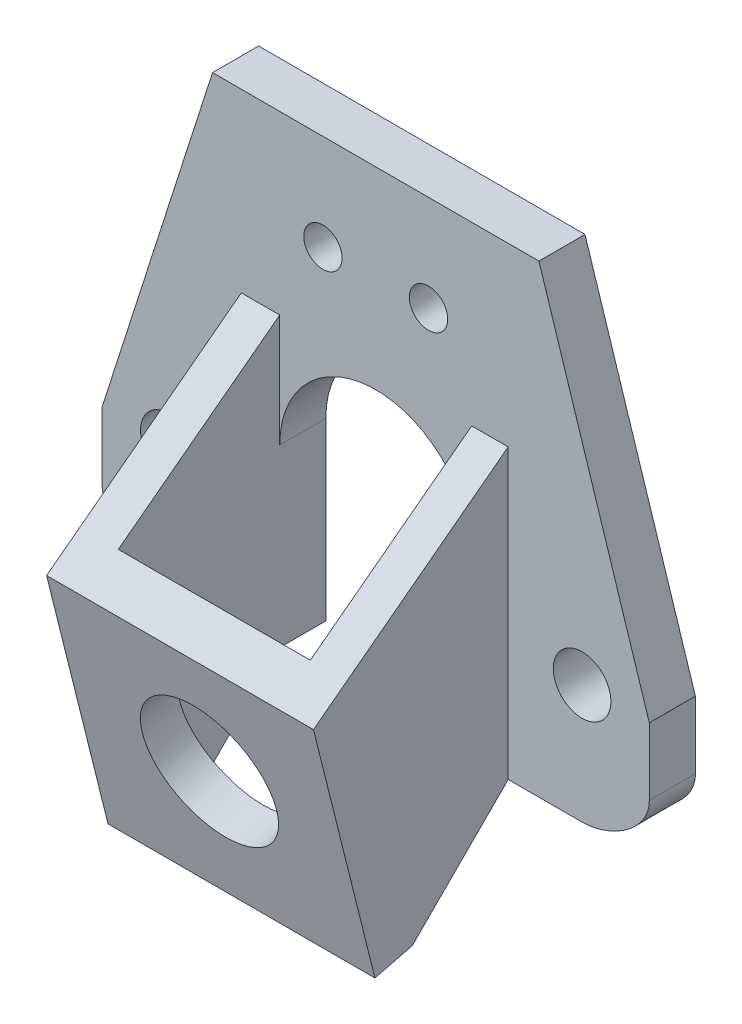
ISO-10303-21;
HEADER;
FILE_DESCRIPTION(('STEP AP214'),'2;1');
FILE_NAME('part.step','',(''),(''),'','','');
FILE_SCHEMA(('AUTOMOTIVE_DESIGN { 1 0 10303 214 1 1 1 1 }'));
ENDSEC;
DATA;
#1=APPLICATION_CONTEXT('core data for automotive mechanical design processes');
#2=APPLICATION_PROTOCOL_DEFINITION('international standard','automotive_design',2000,#1);
#3=PRODUCT_CONTEXT('',#1,'mechanical');
#4=PRODUCT('Part','Part','',(#3));
#5=PRODUCT_RELATED_PRODUCT_CATEGORY('part','',(#4));
#6=PRODUCT_DEFINITION_FORMATION('','',#4);
#7=PRODUCT_DEFINITION_CONTEXT('part definition',#1,'design');
#8=PRODUCT_DEFINITION('design','',#6,#7);
#9=PRODUCT_DEFINITION_SHAPE('','',#8);
#10=(LENGTH_UNIT() NAMED_UNIT(*) SI_UNIT(.MILLI.,.METRE.));
#11=(NAMED_UNIT(*) PLANE_ANGLE_UNIT() SI_UNIT($,.RADIAN.));
#12=(NAMED_UNIT(*) SI_UNIT($,.STERADIAN.) SOLID_ANGLE_UNIT());
#13=UNCERTAINTY_MEASURE_WITH_UNIT(LENGTH_MEASURE(1.E-05),#10,'distance_accuracy_value','');
#14=(GEOMETRIC_REPRESENTATION_CONTEXT(3) GLOBAL_UNCERTAINTY_ASSIGNED_CONTEXT((#13)) GLOBAL_UNIT_ASSIGNED_CONTEXT((#10,
#11,#12)) REPRESENTATION_CONTEXT('',''));
#15=CARTESIAN_POINT('',(0.,0.,0.));
#16=DIRECTION('',(0.,0.,1.));
#17=DIRECTION('',(1.,0.,0.));
#18=AXIS2_PLACEMENT_3D('',#15,#16,#17);
#19=CARTESIAN_POINT('',(38.2414330517244,16.7586546031953,2.4));
#20=DIRECTION('',(0.,0.,1.));
#21=DIRECTION('',(1.,0.,0.));
#22=AXIS2_PLACEMENT_3D('',#19,#20,#21);
#23=PLANE('',#22);
#24=DIRECTION('',(-0.305008216815259,0.9523497192078,0.));
#25=VECTOR('',#24,1.);
#26=CARTESIAN_POINT('',(33.6865114727916,40.1326961955504,2.4));
#27=LINE('',#26,#25);
#28=CARTESIAN_POINT('',(39.4365114727916,22.1790458230372,2.4));
#29=VERTEX_POINT('',#28);
#30=CARTESIAN_POINT('',(33.6865114727916,40.1326961955504,2.4));
#31=VERTEX_POINT('',#30);
#32=EDGE_CURVE('E243',#29,#31,#27,.T.);
#33=ORIENTED_EDGE('',*,*,#32,.T.);
#34=DIRECTION('',(-1.,0.,0.));
#35=VECTOR('',#34,1.);
#36=CARTESIAN_POINT('',(25.1865114727916,40.1326961955504,2.4));
#37=LINE('',#36,#35);
#38=CARTESIAN_POINT('',(16.6865114727916,40.1326961955504,2.4));
#39=VERTEX_POINT('',#38);
#40=EDGE_CURVE('E245',#31,#39,#37,.T.);
#41=ORIENTED_EDGE('',*,*,#40,.T.);
#42=DIRECTION('',(-0.305008216815259,-0.9523497192078,0.));
#43=VECTOR('',#42,1.);
#44=CARTESIAN_POINT('',(16.6865114727916,40.1326961955504,2.4));
#45=LINE('',#44,#43);
#46=CARTESIAN_POINT('',(10.9365114727916,22.1790458230372,2.4));
#47=VERTEX_POINT('',#46);
#48=EDGE_CURVE('E247',#39,#47,#45,.T.);
#49=ORIENTED_EDGE('',*,*,#48,.T.);
#50=DIRECTION('',(0.,-1.,0.));
#51=VECTOR('',#50,1.);
#52=CARTESIAN_POINT('',(10.9365114727916,22.1790458230372,2.4));
#53=LINE('',#52,#51);
#54=CARTESIAN_POINT('',(10.9365114727916,18.6790458230372,2.4));
#55=VERTEX_POINT('',#54);
#56=EDGE_CURVE('E249',#47,#55,#53,.T.);
#57=ORIENTED_EDGE('',*,*,#56,.T.);
#58=CARTESIAN_POINT('',(10.9365114727916,18.6790458230372,2.4));
#59=CARTESIAN_POINT('',(10.9365114727916,17.1992549458831,2.4));
#60=CARTESIAN_POINT('',(12.9567205956374,15.948106541219,2.4));
#61=CARTESIAN_POINT('',(14.4365114727916,15.948106541219,2.4));
#62=B_SPLINE_CURVE_WITH_KNOTS('',3,(#58,#59,#60,#61),.UNSPECIFIED.,.F.,.F.,(4,4),(0.,
4.43937263146244),.UNSPECIFIED.);
#63=CARTESIAN_POINT('',(14.4365114727916,15.948106541219,2.4));
#64=VERTEX_POINT('',#63);
#65=EDGE_CURVE('E251',#55,#64,#62,.T.);
#66=ORIENTED_EDGE('',*,*,#65,.T.);
#67=DIRECTION('',(1.,0.,0.));
#68=VECTOR('',#67,1.);
#69=CARTESIAN_POINT('',(14.4365114727916,15.948106541219,2.4));
#70=LINE('',#69,#68);
#71=CARTESIAN_POINT('',(18.1865114727916,15.948106541219,2.4));
#72=VERTEX_POINT('',#71);
#73=EDGE_CURVE('E191',#64,#72,#70,.T.);
#74=ORIENTED_EDGE('',*,*,#73,.T.);
#75=DIRECTION('',(0.,-1.,0.));
#76=VECTOR('',#75,1.);
#77=CARTESIAN_POINT('',(18.1865114727916,30.948106541219,2.4));
#78=LINE('',#77,#76);
#79=CARTESIAN_POINT('',(18.1865114727916,30.948106541219,2.4));
#80=VERTEX_POINT('',#79);
#81=EDGE_CURVE('E176',#80,#72,#78,.T.);
#82=ORIENTED_EDGE('',*,*,#81,.F.);
#83=DIRECTION('',(-1.,0.,0.));
#84=VECTOR('',#83,1.);
#85=CARTESIAN_POINT('',(20.1865114727916,30.948106541219,2.4));
#86=LINE('',#85,#84);
#87=CARTESIAN_POINT('',(20.1865114727916,30.948106541219,2.4));
#88=VERTEX_POINT('',#87);
#89=EDGE_CURVE('E168',#88,#80,#86,.T.);
#90=ORIENTED_EDGE('',*,*,#89,.F.);
#91=DIRECTION('',(0.,1.,0.));
#92=VECTOR('',#91,1.);
#93=CARTESIAN_POINT('',(20.1865114727916,30.948106541219,2.4));
#94=LINE('',#93,#92);
#95=CARTESIAN_POINT('',(20.1865114727916,25.0819555716555,2.4));
#96=VERTEX_POINT('',#95);
#97=EDGE_CURVE('E177',#96,#88,#94,.T.);
#98=ORIENTED_EDGE('',*,*,#97,.F.);
#99=CARTESIAN_POINT('',(25.1865114727916,25.0819555716555,2.4));
#100=DIRECTION('',(0.,0.,-1.));
#101=DIRECTION('',(1.,0.,0.));
#102=AXIS2_PLACEMENT_3D('',#99,#100,#101);
#103=CIRCLE('',#102,5.);
#104=CARTESIAN_POINT('',(30.1865114727916,25.0819555716555,2.4));
#105=VERTEX_POINT('',#104);
#106=EDGE_CURVE('E477',#96,#105,#103,.T.);
#107=ORIENTED_EDGE('',*,*,#106,.T.);
#108=DIRECTION('',(0.,-1.,0.));
#109=VECTOR('',#108,1.);
#110=CARTESIAN_POINT('',(30.1865114727916,30.948106541219,2.4));
#111=LINE('',#110,#109);
#112=CARTESIAN_POINT('',(30.1865114727916,30.948106541219,2.4));
#113=VERTEX_POINT('',#112);
#114=EDGE_CURVE('E195',#113,#105,#111,.T.);
#115=ORIENTED_EDGE('',*,*,#114,.F.);
#116=DIRECTION('',(-1.,0.,0.));
#117=VECTOR('',#116,1.);
#118=CARTESIAN_POINT('',(30.1865114727916,30.948106541219,2.4));
#119=LINE('',#118,#117);
#120=CARTESIAN_POINT('',(32.0865114727916,30.948106541219,2.4));
#121=VERTEX_POINT('',#120);
#122=EDGE_CURVE('E201',#121,#113,#119,.T.);
#123=ORIENTED_EDGE('',*,*,#122,.F.);
#124=DIRECTION('',(0.,1.,0.));
#125=VECTOR('',#124,1.);
#126=CARTESIAN_POINT('',(32.0865114727916,30.948106541219,2.4));
#127=LINE('',#126,#125);
#128=CARTESIAN_POINT('',(32.0865114727916,15.948106541219,2.4));
#129=VERTEX_POINT('',#128);
#130=EDGE_CURVE('E202',#129,#121,#127,.T.);
#131=ORIENTED_EDGE('',*,*,#130,.F.);
#132=DIRECTION('',(1.,0.,0.));
#133=VECTOR('',#132,1.);
#134=CARTESIAN_POINT('',(30.1865114727916,15.948106541219,2.4));
#135=LINE('',#134,#133);
#136=CARTESIAN_POINT('',(35.9365114727916,15.948106541219,2.4));
#137=VERTEX_POINT('',#136);
#138=EDGE_CURVE('E476',#129,#137,#135,.T.);
#139=ORIENTED_EDGE('',*,*,#138,.T.);
#140=CARTESIAN_POINT('',(35.9365114727916,15.948106541219,2.4));
#141=CARTESIAN_POINT('',(37.4163023499458,15.948106541219,2.4));
#142=CARTESIAN_POINT('',(39.4365114727916,17.1992549458831,2.4));
#143=CARTESIAN_POINT('',(39.4365114727916,18.6790458230372,2.4));
#144=B_SPLINE_CURVE_WITH_KNOTS('',3,(#140,#141,#142,#143),.UNSPECIFIED.,.F.,.F.,(4,4),(0.,
4.43937263146244),.UNSPECIFIED.);
#145=CARTESIAN_POINT('',(39.4365114727916,18.6790458230372,2.4));
#146=VERTEX_POINT('',#145);
#147=EDGE_CURVE('E231',#137,#146,#144,.T.);
#148=ORIENTED_EDGE('',*,*,#147,.T.);
#149=DIRECTION('',(0.,1.,0.));
#150=VECTOR('',#149,1.);
#151=CARTESIAN_POINT('',(39.4365114727916,22.1790458230372,2.4));
#152=LINE('',#151,#150);
#153=EDGE_CURVE('E237',#146,#29,#152,.T.);
#154=ORIENTED_EDGE('',*,*,#153,.T.);
#155=EDGE_LOOP('',(#33,#41,#49,#57,#66,#74,#82,#90,#98,#107,#115,#123,#131,#139,#148,#154));
#156=FACE_BOUND('',#155,.T.);
#157=CARTESIAN_POINT('',(35.9365114727916,22.1326961955504,2.4));
#158=DIRECTION('',(0.,0.,1.));
#159=DIRECTION('',(1.,0.,0.));
#160=AXIS2_PLACEMENT_3D('',#157,#158,#159);
#161=CIRCLE('',#160,1.5);
#162=CARTESIAN_POINT('',(37.4365114727916,22.1326961955504,2.4));
#163=VERTEX_POINT('',#162);
#164=EDGE_CURVE('E220',#163,#163,#161,.T.);
#165=ORIENTED_EDGE('',*,*,#164,.F.);
#166=EDGE_LOOP('',(#165));
#167=FACE_BOUND('',#166,.T.);
#168=CARTESIAN_POINT('',(22.4365114727916,35.1326961955504,2.4));
#169=DIRECTION('',(0.,0.,1.));
#170=DIRECTION('',(1.,0.,0.));
#171=AXIS2_PLACEMENT_3D('',#168,#169,#170);
#172=CIRCLE('',#171,1.);
#173=CARTESIAN_POINT('',(23.4365114727916,35.1326961955504,2.4));
#174=VERTEX_POINT('',#173);
#175=EDGE_CURVE('E208',#174,#174,#172,.T.);
#176=ORIENTED_EDGE('',*,*,#175,.F.);
#177=EDGE_LOOP('',(#176));
#178=FACE_BOUND('',#177,.T.);
#179=CARTESIAN_POINT('',(14.4365114727916,22.1326961955504,2.4));
#180=DIRECTION('',(0.,0.,1.));
#181=DIRECTION('',(1.,0.,0.));
#182=AXIS2_PLACEMENT_3D('',#179,#180,#181);
#183=CIRCLE('',#182,1.5);
#184=CARTESIAN_POINT('',(15.9365114727916,22.1326961955504,2.4));
#185=VERTEX_POINT('',#184);
#186=EDGE_CURVE('E226',#185,#185,#183,.T.);
#187=ORIENTED_EDGE('',*,*,#186,.F.);
#188=EDGE_LOOP('',(#187));
#189=FACE_BOUND('',#188,.T.);
#190=CARTESIAN_POINT('',(27.9365114727916,35.1326961955504,2.4));
#191=DIRECTION('',(0.,0.,1.));
#192=DIRECTION('',(1.,0.,0.));
#193=AXIS2_PLACEMENT_3D('',#190,#191,#192);
#194=CIRCLE('',#193,0.999999999999998);
#195=CARTESIAN_POINT('',(28.9365114727916,35.1326961955504,2.4));
#196=VERTEX_POINT('',#195);
#197=EDGE_CURVE('E214',#196,#196,#194,.T.);
#198=ORIENTED_EDGE('',*,*,#197,.F.);
#199=EDGE_LOOP('',(#198));
#200=FACE_BOUND('',#199,.T.);
#201=ADVANCED_FACE('F33',(#156,#167,#178,#189,#200),#23,.T.);
#202=CARTESIAN_POINT('',(38.2414330517244,16.7586546031953,0.));
#203=DIRECTION('',(0.,0.,1.));
#204=DIRECTION('',(1.,0.,0.));
#205=AXIS2_PLACEMENT_3D('',#202,#203,#204);
#206=PLANE('',#205);
#207=CARTESIAN_POINT('',(35.9365114727916,15.948106541219,0.));
#208=CARTESIAN_POINT('',(37.4163023499458,15.948106541219,0.));
#209=CARTESIAN_POINT('',(39.4365114727916,17.1992549458831,0.));
#210=CARTESIAN_POINT('',(39.4365114727916,18.6790458230372,0.));
#211=B_SPLINE_CURVE_WITH_KNOTS('',3,(#207,#208,#209,#210),.UNSPECIFIED.,.F.,.F.,(4,4),(0.,
4.43937263146244),.UNSPECIFIED.);
#212=CARTESIAN_POINT('',(35.9365114727916,15.948106541219,0.));
#213=VERTEX_POINT('',#212);
#214=CARTESIAN_POINT('',(39.4365114727916,18.6790458230372,0.));
#215=VERTEX_POINT('',#214);
#216=EDGE_CURVE('E229',#213,#215,#211,.T.);
#217=ORIENTED_EDGE('',*,*,#216,.F.);
#218=DIRECTION('',(1.,0.,0.));
#219=VECTOR('',#218,1.);
#220=CARTESIAN_POINT('',(30.1865114727916,15.948106541219,0.));
#221=LINE('',#220,#219);
#222=CARTESIAN_POINT('',(30.1865114727916,15.948106541219,0.));
#223=VERTEX_POINT('',#222);
#224=EDGE_CURVE('E238',#223,#213,#221,.T.);
#225=ORIENTED_EDGE('',*,*,#224,.F.);
#226=DIRECTION('',(0.,-1.,0.));
#227=VECTOR('',#226,1.);
#228=CARTESIAN_POINT('',(30.1865114727916,25.0819555716555,0.));
#229=LINE('',#228,#227);
#230=CARTESIAN_POINT('',(30.1865114727916,25.0819555716555,0.));
#231=VERTEX_POINT('',#230);
#232=EDGE_CURVE('E466',#231,#223,#229,.T.);
#233=ORIENTED_EDGE('',*,*,#232,.F.);
#234=CARTESIAN_POINT('',(25.1865114727916,25.0819555716555,0.));
#235=DIRECTION('',(0.,0.,-1.));
#236=DIRECTION('',(1.,0.,0.));
#237=AXIS2_PLACEMENT_3D('',#234,#235,#236);
#238=CIRCLE('',#237,5.);
#239=CARTESIAN_POINT('',(20.1865114727916,25.0819555716555,0.));
#240=VERTEX_POINT('',#239);
#241=EDGE_CURVE('E464',#240,#231,#238,.T.);
#242=ORIENTED_EDGE('',*,*,#241,.F.);
#243=DIRECTION('',(0.,1.,0.));
#244=VECTOR('',#243,1.);
#245=CARTESIAN_POINT('',(20.1865114727916,25.0819555716555,0.));
#246=LINE('',#245,#244);
#247=CARTESIAN_POINT('',(20.1865114727916,15.948106541219,0.));
#248=VERTEX_POINT('',#247);
#249=EDGE_CURVE('E462',#248,#240,#246,.T.);
#250=ORIENTED_EDGE('',*,*,#249,.F.);
#251=DIRECTION('',(1.,0.,0.));
#252=VECTOR('',#251,1.);
#253=CARTESIAN_POINT('',(14.4365114727916,15.948106541219,0.));
#254=LINE('',#253,#252);
#255=CARTESIAN_POINT('',(14.4365114727916,15.948106541219,0.));
#256=VERTEX_POINT('',#255);
#257=EDGE_CURVE('E401',#256,#248,#254,.T.);
#258=ORIENTED_EDGE('',*,*,#257,.F.);
#259=CARTESIAN_POINT('',(10.9365114727916,18.6790458230372,0.));
#260=CARTESIAN_POINT('',(10.9365114727916,17.1992549458831,0.));
#261=CARTESIAN_POINT('',(12.9567205956374,15.948106541219,0.));
#262=CARTESIAN_POINT('',(14.4365114727916,15.948106541219,0.));
#263=B_SPLINE_CURVE_WITH_KNOTS('',3,(#259,#260,#261,#262),.UNSPECIFIED.,.F.,.F.,(4,4),(0.,
4.43937263146244),.UNSPECIFIED.);
#264=CARTESIAN_POINT('',(10.9365114727916,18.6790458230372,0.));
#265=VERTEX_POINT('',#264);
#266=EDGE_CURVE('E454',#265,#256,#263,.T.);
#267=ORIENTED_EDGE('',*,*,#266,.F.);
#268=DIRECTION('',(0.,-1.,0.));
#269=VECTOR('',#268,1.);
#270=CARTESIAN_POINT('',(10.9365114727916,22.1790458230372,0.));
#271=LINE('',#270,#269);
#272=CARTESIAN_POINT('',(10.9365114727916,22.1790458230372,0.));
#273=VERTEX_POINT('',#272);
#274=EDGE_CURVE('E452',#273,#265,#271,.T.);
#275=ORIENTED_EDGE('',*,*,#274,.F.);
#276=DIRECTION('',(-0.305008216815259,-0.9523497192078,0.));
#277=VECTOR('',#276,1.);
#278=CARTESIAN_POINT('',(16.6865114727916,40.1326961955504,0.));
#279=LINE('',#278,#277);
#280=CARTESIAN_POINT('',(16.6865114727916,40.1326961955504,0.));
#281=VERTEX_POINT('',#280);
#282=EDGE_CURVE('E450',#281,#273,#279,.T.);
#283=ORIENTED_EDGE('',*,*,#282,.F.);
#284=DIRECTION('',(-1.,0.,0.));
#285=VECTOR('',#284,1.);
#286=CARTESIAN_POINT('',(25.1865114727916,40.1326961955504,0.));
#287=LINE('',#286,#285);
#288=CARTESIAN_POINT('',(33.6865114727916,40.1326961955504,0.));
#289=VERTEX_POINT('',#288);
#290=EDGE_CURVE('E448',#289,#281,#287,.T.);
#291=ORIENTED_EDGE('',*,*,#290,.F.);
#292=DIRECTION('',(-0.305008216815259,0.9523497192078,0.));
#293=VECTOR('',#292,1.);
#294=CARTESIAN_POINT('',(33.6865114727916,40.1326961955504,0.));
#295=LINE('',#294,#293);
#296=CARTESIAN_POINT('',(39.4365114727916,22.1790458230372,0.));
#297=VERTEX_POINT('',#296);
#298=EDGE_CURVE('E437',#297,#289,#295,.T.);
#299=ORIENTED_EDGE('',*,*,#298,.F.);
#300=DIRECTION('',(0.,1.,0.));
#301=VECTOR('',#300,1.);
#302=CARTESIAN_POINT('',(39.4365114727916,22.1790458230372,0.));
#303=LINE('',#302,#301);
#304=EDGE_CURVE('E429',#215,#297,#303,.T.);
#305=ORIENTED_EDGE('',*,*,#304,.F.);
#306=EDGE_LOOP('',(#217,#225,#233,#242,#250,#258,#267,#275,#283,#291,#299,#305));
#307=FACE_BOUND('',#306,.T.);
#308=CARTESIAN_POINT('',(14.4365114727916,22.1326961955504,0.));
#309=DIRECTION('',(0.,0.,1.));
#310=DIRECTION('',(1.,0.,0.));
#311=AXIS2_PLACEMENT_3D('',#308,#309,#310);
#312=CIRCLE('',#311,1.5);
#313=CARTESIAN_POINT('',(15.9365114727916,22.1326961955504,0.));
#314=VERTEX_POINT('',#313);
#315=EDGE_CURVE('E223',#314,#314,#312,.T.);
#316=ORIENTED_EDGE('',*,*,#315,.T.);
#317=EDGE_LOOP('',(#316));
#318=FACE_BOUND('',#317,.T.);
#319=CARTESIAN_POINT('',(35.9365114727916,22.1326961955504,0.));
#320=DIRECTION('',(0.,0.,1.));
#321=DIRECTION('',(1.,0.,0.));
#322=AXIS2_PLACEMENT_3D('',#319,#320,#321);
#323=CIRCLE('',#322,1.5);
#324=CARTESIAN_POINT('',(37.4365114727916,22.1326961955504,0.));
#325=VERTEX_POINT('',#324);
#326=EDGE_CURVE('E217',#325,#325,#323,.T.);
#327=ORIENTED_EDGE('',*,*,#326,.T.);
#328=EDGE_LOOP('',(#327));
#329=FACE_BOUND('',#328,.T.);
#330=CARTESIAN_POINT('',(27.9365114727916,35.1326961955504,0.));
#331=DIRECTION('',(0.,0.,1.));
#332=DIRECTION('',(1.,0.,0.));
#333=AXIS2_PLACEMENT_3D('',#330,#331,#332);
#334=CIRCLE('',#333,0.999999999999998);
#335=CARTESIAN_POINT('',(28.9365114727916,35.1326961955504,0.));
#336=VERTEX_POINT('',#335);
#337=EDGE_CURVE('E211',#336,#336,#334,.T.);
#338=ORIENTED_EDGE('',*,*,#337,.T.);
#339=EDGE_LOOP('',(#338));
#340=FACE_BOUND('',#339,.T.);
#341=CARTESIAN_POINT('',(22.4365114727916,35.1326961955504,0.));
#342=DIRECTION('',(0.,0.,1.));
#343=DIRECTION('',(1.,0.,0.));
#344=AXIS2_PLACEMENT_3D('',#341,#342,#343);
#345=CIRCLE('',#344,1.);
#346=CARTESIAN_POINT('',(23.4365114727916,35.1326961955504,0.));
#347=VERTEX_POINT('',#346);
#348=EDGE_CURVE('E207',#347,#347,#345,.T.);
#349=ORIENTED_EDGE('',*,*,#348,.T.);
#350=EDGE_LOOP('',(#349));
#351=FACE_BOUND('',#350,.T.);
#352=ADVANCED_FACE('F289',(#307,#318,#329,#340,#351),#206,.F.);
#353=DIRECTION('',(0.,0.,-1.));
#354=VECTOR('',#353,1.);
#355=SURFACE_OF_LINEAR_EXTRUSION('',#144,#354);
#356=ORIENTED_EDGE('',*,*,#216,.T.);
#357=DIRECTION('',(0.,0.,-1.));
#358=VECTOR('',#357,1.);
#359=CARTESIAN_POINT('',(39.4365114727916,18.6790458230372,2.4));
#360=LINE('',#359,#358);
#361=EDGE_CURVE('E205',#146,#215,#360,.T.);
#362=ORIENTED_EDGE('',*,*,#361,.F.);
#363=ORIENTED_EDGE('',*,*,#147,.F.);
#364=DIRECTION('',(0.,0.,-1.));
#365=VECTOR('',#364,1.);
#366=CARTESIAN_POINT('',(35.9365114727916,15.948106541219,2.4));
#367=LINE('',#366,#365);
#368=EDGE_CURVE('E434',#137,#213,#367,.T.);
#369=ORIENTED_EDGE('',*,*,#368,.T.);
#370=EDGE_LOOP('',(#356,#362,#363,#369));
#371=FACE_BOUND('',#370,.T.);
#372=ADVANCED_FACE('F35',(#371),#355,.F.);
#373=CARTESIAN_POINT('',(39.4365114727916,22.1790458230372,2.4));
#374=DIRECTION('',(-1.,0.,0.));
#375=DIRECTION('',(0.,0.,1.));
#376=AXIS2_PLACEMENT_3D('',#373,#374,#375);
#377=PLANE('',#376);
#378=ORIENTED_EDGE('',*,*,#304,.T.);
#379=DIRECTION('',(0.,0.,-1.));
#380=VECTOR('',#379,1.);
#381=CARTESIAN_POINT('',(39.4365114727916,22.1790458230372,2.4));
#382=LINE('',#381,#380);
#383=EDGE_CURVE('E422',#29,#297,#382,.T.);
#384=ORIENTED_EDGE('',*,*,#383,.F.);
#385=ORIENTED_EDGE('',*,*,#153,.F.);
#386=ORIENTED_EDGE('',*,*,#361,.T.);
#387=EDGE_LOOP('',(#378,#384,#385,#386));
#388=FACE_BOUND('',#387,.T.);
#389=ADVANCED_FACE('F282',(#388),#377,.F.);
#390=CARTESIAN_POINT('',(33.6865114727916,40.1326961955504,2.4));
#391=DIRECTION('',(-0.9523497192078,-0.305008216815259,0.));
#392=DIRECTION('',(0.305008216815259,-0.9523497192078,0.));
#393=AXIS2_PLACEMENT_3D('',#390,#391,#392);
#394=PLANE('',#393);
#395=ORIENTED_EDGE('',*,*,#298,.T.);
#396=DIRECTION('',(0.,0.,-1.));
#397=VECTOR('',#396,1.);
#398=CARTESIAN_POINT('',(33.6865114727916,40.1326961955504,2.4));
#399=LINE('',#398,#397);
#400=EDGE_CURVE('E419',#31,#289,#399,.T.);
#401=ORIENTED_EDGE('',*,*,#400,.F.);
#402=ORIENTED_EDGE('',*,*,#32,.F.);
#403=ORIENTED_EDGE('',*,*,#383,.T.);
#404=EDGE_LOOP('',(#395,#401,#402,#403));
#405=FACE_BOUND('',#404,.T.);
#406=ADVANCED_FACE('F279',(#405),#394,.F.);
#407=CARTESIAN_POINT('',(25.1865114727916,40.1326961955504,2.4));
#408=DIRECTION('',(0.,-1.,0.));
#409=DIRECTION('',(0.,0.,-1.));
#410=AXIS2_PLACEMENT_3D('',#407,#408,#409);
#411=PLANE('',#410);
#412=ORIENTED_EDGE('',*,*,#290,.T.);
#413=DIRECTION('',(0.,0.,-1.));
#414=VECTOR('',#413,1.);
#415=CARTESIAN_POINT('',(16.6865114727916,40.1326961955504,2.4));
#416=LINE('',#415,#414);
#417=EDGE_CURVE('E416',#39,#281,#416,.T.);
#418=ORIENTED_EDGE('',*,*,#417,.F.);
#419=ORIENTED_EDGE('',*,*,#40,.F.);
#420=ORIENTED_EDGE('',*,*,#400,.T.);
#421=EDGE_LOOP('',(#412,#418,#419,#420));
#422=FACE_BOUND('',#421,.T.);
#423=ADVANCED_FACE('F275',(#422),#411,.F.);
#424=CARTESIAN_POINT('',(16.6865114727916,40.1326961955504,2.4));
#425=DIRECTION('',(0.9523497192078,-0.305008216815259,0.));
#426=DIRECTION('',(0.305008216815259,0.9523497192078,0.));
#427=AXIS2_PLACEMENT_3D('',#424,#425,#426);
#428=PLANE('',#427);
#429=ORIENTED_EDGE('',*,*,#282,.T.);
#430=DIRECTION('',(0.,0.,-1.));
#431=VECTOR('',#430,1.);
#432=CARTESIAN_POINT('',(10.9365114727916,22.1790458230372,2.4));
#433=LINE('',#432,#431);
#434=EDGE_CURVE('E413',#47,#273,#433,.T.);
#435=ORIENTED_EDGE('',*,*,#434,.F.);
#436=ORIENTED_EDGE('',*,*,#48,.F.);
#437=ORIENTED_EDGE('',*,*,#417,.T.);
#438=EDGE_LOOP('',(#429,#435,#436,#437));
#439=FACE_BOUND('',#438,.T.);
#440=ADVANCED_FACE('F271',(#439),#428,.F.);
#441=CARTESIAN_POINT('',(10.9365114727916,22.1790458230372,2.4));
#442=DIRECTION('',(1.,0.,0.));
#443=DIRECTION('',(0.,0.,-1.));
#444=AXIS2_PLACEMENT_3D('',#441,#442,#443);
#445=PLANE('',#444);
#446=ORIENTED_EDGE('',*,*,#274,.T.);
#447=DIRECTION('',(0.,0.,-1.));
#448=VECTOR('',#447,1.);
#449=CARTESIAN_POINT('',(10.9365114727916,18.6790458230372,2.4));
#450=LINE('',#449,#448);
#451=EDGE_CURVE('E405',#55,#265,#450,.T.);
#452=ORIENTED_EDGE('',*,*,#451,.F.);
#453=ORIENTED_EDGE('',*,*,#56,.F.);
#454=ORIENTED_EDGE('',*,*,#434,.T.);
#455=EDGE_LOOP('',(#446,#452,#453,#454));
#456=FACE_BOUND('',#455,.T.);
#457=ADVANCED_FACE('F266',(#456),#445,.F.);
#458=DIRECTION('',(0.,0.,-1.));
#459=VECTOR('',#458,1.);
#460=SURFACE_OF_LINEAR_EXTRUSION('',#62,#459);
#461=ORIENTED_EDGE('',*,*,#266,.T.);
#462=DIRECTION('',(0.,0.,-1.));
#463=VECTOR('',#462,1.);
#464=CARTESIAN_POINT('',(14.4365114727916,15.948106541219,2.4));
#465=LINE('',#464,#463);
#466=EDGE_CURVE('E403',#64,#256,#465,.T.);
#467=ORIENTED_EDGE('',*,*,#466,.F.);
#468=ORIENTED_EDGE('',*,*,#65,.F.);
#469=ORIENTED_EDGE('',*,*,#451,.T.);
#470=EDGE_LOOP('',(#461,#467,#468,#469));
#471=FACE_BOUND('',#470,.T.);
#472=ADVANCED_FACE('F261',(#471),#460,.F.);
#473=CARTESIAN_POINT('',(14.4365114727916,15.948106541219,2.4));
#474=DIRECTION('',(0.,1.,0.));
#475=DIRECTION('',(-1.,0.,0.));
#476=AXIS2_PLACEMENT_3D('',#473,#474,#475);
#477=PLANE('',#476);
#478=ORIENTED_EDGE('',*,*,#257,.T.);
#479=DIRECTION('',(0.,0.,-1.));
#480=VECTOR('',#479,1.);
#481=CARTESIAN_POINT('',(20.1865114727916,15.948106541219,2.4));
#482=LINE('',#481,#480);
#483=CARTESIAN_POINT('',(20.1865114727916,15.948106541219,2.4));
#484=VERTEX_POINT('',#483);
#485=EDGE_CURVE('E399',#484,#248,#482,.T.);
#486=ORIENTED_EDGE('',*,*,#485,.F.);
#487=DIRECTION('',(-1.,0.,0.));
#488=VECTOR('',#487,1.);
#489=CARTESIAN_POINT('',(14.4365114727916,15.948106541219,2.4));
#490=LINE('',#489,#488);
#491=EDGE_CURVE('E192',#484,#72,#490,.T.);
#492=ORIENTED_EDGE('',*,*,#491,.T.);
#493=ORIENTED_EDGE('',*,*,#73,.F.);
#494=ORIENTED_EDGE('',*,*,#466,.T.);
#495=EDGE_LOOP('',(#478,#486,#492,#493,#494));
#496=FACE_BOUND('',#495,.T.);
#497=ADVANCED_FACE('F265',(#496),#477,.F.);
#498=CARTESIAN_POINT('',(20.1865114727916,25.0819555716555,2.4));
#499=DIRECTION('',(-1.,0.,0.));
#500=DIRECTION('',(0.,0.,1.));
#501=AXIS2_PLACEMENT_3D('',#498,#499,#500);
#502=PLANE('',#501);
#503=ORIENTED_EDGE('',*,*,#97,.T.);
#504=DIRECTION('',(0.,-0.60369811986539,0.797213007966499));
#505=VECTOR('',#504,1.);
#506=CARTESIAN_POINT('',(20.1865114727916,28.8101794908437,5.22323763907479));
#507=LINE('',#506,#505);
#508=CARTESIAN_POINT('',(20.1865114727916,24.5809066813591,10.808200035035));
#509=VERTEX_POINT('',#508);
#510=EDGE_CURVE('E171',#88,#509,#507,.T.);
#511=ORIENTED_EDGE('',*,*,#510,.T.);
#512=DIRECTION('',(0.,-0.970142500145332,-0.242535625036333));
#513=VECTOR('',#512,1.);
#514=CARTESIAN_POINT('',(20.1865114727916,23.0740820992769,10.4314938895145));
#515=LINE('',#514,#513);
#516=CARTESIAN_POINT('',(20.1865114727916,10.948106541219,7.4));
#517=VERTEX_POINT('',#516);
#518=EDGE_CURVE('E337',#509,#517,#515,.T.);
#519=ORIENTED_EDGE('',*,*,#518,.T.);
#520=DIRECTION('',(0.,0.707106781186548,-0.707106781186547));
#521=VECTOR('',#520,1.);
#522=CARTESIAN_POINT('',(20.1865114727916,20.5150310564373,-2.16692451521828));
#523=LINE('',#522,#521);
#524=EDGE_CURVE('E324',#517,#484,#523,.T.);
#525=ORIENTED_EDGE('',*,*,#524,.T.);
#526=ORIENTED_EDGE('',*,*,#485,.T.);
#527=ORIENTED_EDGE('',*,*,#249,.T.);
#528=DIRECTION('',(0.,0.,-1.));
#529=VECTOR('',#528,1.);
#530=CARTESIAN_POINT('',(20.1865114727916,25.0819555716555,2.4));
#531=LINE('',#530,#529);
#532=EDGE_CURVE('E323',#96,#240,#531,.T.);
#533=ORIENTED_EDGE('',*,*,#532,.F.);
#534=EDGE_LOOP('',(#503,#511,#519,#525,#526,#527,#533));
#535=FACE_BOUND('',#534,.T.);
#536=ADVANCED_FACE('F312',(#535),#502,.F.);
#537=CARTESIAN_POINT('',(25.1865114727916,25.0819555716555,2.4));
#538=DIRECTION('',(0.,0.,-1.));
#539=DIRECTION('',(-1.,0.,0.));
#540=AXIS2_PLACEMENT_3D('',#537,#538,#539);
#541=CYLINDRICAL_SURFACE('',#540,5.);
#542=ORIENTED_EDGE('',*,*,#241,.T.);
#543=DIRECTION('',(0.,0.,-1.));
#544=VECTOR('',#543,1.);
#545=CARTESIAN_POINT('',(30.1865114727916,25.0819555716555,2.4));
#546=LINE('',#545,#544);
#547=EDGE_CURVE('E407',#105,#231,#546,.T.);
#548=ORIENTED_EDGE('',*,*,#547,.F.);
#549=ORIENTED_EDGE('',*,*,#106,.F.);
#550=ORIENTED_EDGE('',*,*,#532,.T.);
#551=EDGE_LOOP('',(#542,#548,#549,#550));
#552=FACE_BOUND('',#551,.T.);
#553=ADVANCED_FACE('F309',(#552),#541,.F.);
#554=CARTESIAN_POINT('',(30.1865114727916,25.0819555716555,2.4));
#555=DIRECTION('',(1.,0.,0.));
#556=DIRECTION('',(0.,0.,-1.));
#557=AXIS2_PLACEMENT_3D('',#554,#555,#556);
#558=PLANE('',#557);
#559=DIRECTION('',(0.,0.970142500145332,0.242535625036333));
#560=VECTOR('',#559,1.);
#561=CARTESIAN_POINT('',(30.1865114727916,23.0740820992769,10.4314938895145));
#562=LINE('',#561,#560);
#563=CARTESIAN_POINT('',(30.1865114727916,10.948106541219,7.4));
#564=VERTEX_POINT('',#563);
#565=CARTESIAN_POINT('',(30.1865114727916,24.5809066813591,10.808200035035));
#566=VERTEX_POINT('',#565);
#567=EDGE_CURVE('E339',#564,#566,#562,.T.);
#568=ORIENTED_EDGE('',*,*,#567,.T.);
#569=DIRECTION('',(0.,0.60369811986539,-0.797213007966499));
#570=VECTOR('',#569,1.);
#571=CARTESIAN_POINT('',(30.1865114727916,28.8101794908437,5.22323763907479));
#572=LINE('',#571,#570);
#573=EDGE_CURVE('E367',#566,#113,#572,.T.);
#574=ORIENTED_EDGE('',*,*,#573,.T.);
#575=ORIENTED_EDGE('',*,*,#114,.T.);
#576=ORIENTED_EDGE('',*,*,#547,.T.);
#577=ORIENTED_EDGE('',*,*,#232,.T.);
#578=DIRECTION('',(0.,0.,-1.));
#579=VECTOR('',#578,1.);
#580=CARTESIAN_POINT('',(30.1865114727916,15.948106541219,2.4));
#581=LINE('',#580,#579);
#582=CARTESIAN_POINT('',(30.1865114727916,15.948106541219,2.4));
#583=VERTEX_POINT('',#582);
#584=EDGE_CURVE('E378',#583,#223,#581,.T.);
#585=ORIENTED_EDGE('',*,*,#584,.F.);
#586=DIRECTION('',(0.,-0.707106781186548,0.707106781186547));
#587=VECTOR('',#586,1.);
#588=CARTESIAN_POINT('',(30.1865114727916,20.5150310564373,-2.16692451521828));
#589=LINE('',#588,#587);
#590=EDGE_CURVE('E326',#583,#564,#589,.T.);
#591=ORIENTED_EDGE('',*,*,#590,.T.);
#592=EDGE_LOOP('',(#568,#574,#575,#576,#577,#585,#591));
#593=FACE_BOUND('',#592,.T.);
#594=ADVANCED_FACE('F305',(#593),#558,.F.);
#595=CARTESIAN_POINT('',(30.1865114727916,15.948106541219,2.4));
#596=DIRECTION('',(0.,1.,0.));
#597=DIRECTION('',(0.,0.,1.));
#598=AXIS2_PLACEMENT_3D('',#595,#596,#597);
#599=PLANE('',#598);
#600=ORIENTED_EDGE('',*,*,#224,.T.);
#601=ORIENTED_EDGE('',*,*,#368,.F.);
#602=ORIENTED_EDGE('',*,*,#138,.F.);
#603=EDGE_CURVE('E56',#583,#129,#135,.T.);
#604=ORIENTED_EDGE('',*,*,#603,.F.);
#605=ORIENTED_EDGE('',*,*,#584,.T.);
#606=EDGE_LOOP('',(#600,#601,#602,#604,#605));
#607=FACE_BOUND('',#606,.T.);
#608=ADVANCED_FACE('F302',(#607),#599,.F.);
#609=CARTESIAN_POINT('',(14.4365114727916,22.1326961955504,2.4));
#610=DIRECTION('',(0.,0.,-1.));
#611=DIRECTION('',(-1.,0.,0.));
#612=AXIS2_PLACEMENT_3D('',#609,#610,#611);
#613=CYLINDRICAL_SURFACE('',#612,1.5);
#614=ORIENTED_EDGE('',*,*,#186,.T.);
#615=EDGE_LOOP('',(#614));
#616=FACE_BOUND('',#615,.T.);
#617=ORIENTED_EDGE('',*,*,#315,.F.);
#618=EDGE_LOOP('',(#617));
#619=FACE_BOUND('',#618,.T.);
#620=ADVANCED_FACE('F299',(#616,#619),#613,.F.);
#621=CARTESIAN_POINT('',(35.9365114727916,22.1326961955504,2.4));
#622=DIRECTION('',(0.,0.,-1.));
#623=DIRECTION('',(-1.,0.,0.));
#624=AXIS2_PLACEMENT_3D('',#621,#622,#623);
#625=CYLINDRICAL_SURFACE('',#624,1.5);
#626=ORIENTED_EDGE('',*,*,#164,.T.);
#627=EDGE_LOOP('',(#626));
#628=FACE_BOUND('',#627,.T.);
#629=ORIENTED_EDGE('',*,*,#326,.F.);
#630=EDGE_LOOP('',(#629));
#631=FACE_BOUND('',#630,.T.);
#632=ADVANCED_FACE('F511',(#628,#631),#625,.F.);
#633=CARTESIAN_POINT('',(27.9365114727916,35.1326961955504,2.4));
#634=DIRECTION('',(0.,0.,-1.));
#635=DIRECTION('',(-1.,0.,0.));
#636=AXIS2_PLACEMENT_3D('',#633,#634,#635);
#637=CYLINDRICAL_SURFACE('',#636,0.999999999999998);
#638=ORIENTED_EDGE('',*,*,#197,.T.);
#639=EDGE_LOOP('',(#638));
#640=FACE_BOUND('',#639,.T.);
#641=ORIENTED_EDGE('',*,*,#337,.F.);
#642=EDGE_LOOP('',(#641));
#643=FACE_BOUND('',#642,.T.);
#644=ADVANCED_FACE('F503',(#640,#643),#637,.F.);
#645=CARTESIAN_POINT('',(22.4365114727916,35.1326961955504,2.4));
#646=DIRECTION('',(0.,0.,-1.));
#647=DIRECTION('',(-1.,0.,0.));
#648=AXIS2_PLACEMENT_3D('',#645,#646,#647);
#649=CYLINDRICAL_SURFACE('',#648,1.);
#650=ORIENTED_EDGE('',*,*,#175,.T.);
#651=EDGE_LOOP('',(#650));
#652=FACE_BOUND('',#651,.T.);
#653=ORIENTED_EDGE('',*,*,#348,.F.);
#654=EDGE_LOOP('',(#653));
#655=FACE_BOUND('',#654,.T.);
#656=ADVANCED_FACE('F501',(#652,#655),#649,.F.);
#657=CARTESIAN_POINT('',(32.0865114727916,30.948106541219,12.4));
#658=DIRECTION('',(-1.,0.,0.));
#659=DIRECTION('',(0.,0.,1.));
#660=AXIS2_PLACEMENT_3D('',#657,#658,#659);
#661=PLANE('',#660);
#662=ORIENTED_EDGE('',*,*,#130,.T.);
#663=DIRECTION('',(0.,-0.60369811986539,0.797213007966499));
#664=VECTOR('',#663,1.);
#665=CARTESIAN_POINT('',(32.0865114727916,26.1353466008029,8.75548580070993));
#666=LINE('',#665,#664);
#667=CARTESIAN_POINT('',(32.0865114727916,23.2682748032781,12.5415948783236));
#668=VERTEX_POINT('',#667);
#669=EDGE_CURVE('E361',#121,#668,#666,.T.);
#670=ORIENTED_EDGE('',*,*,#669,.T.);
#671=DIRECTION('',(0.,0.970142500145332,0.242535625036333));
#672=VECTOR('',#671,1.);
#673=CARTESIAN_POINT('',(32.0865114727916,30.4630352911463,14.3402850002907));
#674=LINE('',#673,#672);
#675=CARTESIAN_POINT('',(32.0865114727916,10.4630352911463,9.34028500029066));
#676=VERTEX_POINT('',#675);
#677=EDGE_CURVE('E348',#676,#668,#674,.T.);
#678=ORIENTED_EDGE('',*,*,#677,.F.);
#679=DIRECTION('',(0.,0.242535625036333,-0.970142500145332));
#680=VECTOR('',#679,1.);
#681=CARTESIAN_POINT('',(32.0865114727916,10.4630352911463,9.34028500029066));
#682=LINE('',#681,#680);
#683=CARTESIAN_POINT('',(32.0865114727916,10.948106541219,7.4));
#684=VERTEX_POINT('',#683);
#685=EDGE_CURVE('E345',#676,#684,#682,.T.);
#686=ORIENTED_EDGE('',*,*,#685,.T.);
#687=DIRECTION('',(0.,0.707106781186548,-0.707106781186547));
#688=VECTOR('',#687,1.);
#689=CARTESIAN_POINT('',(32.0865114727916,18.448106541219,-0.100000000000006));
#690=LINE('',#689,#688);
#691=EDGE_CURVE('E331',#684,#129,#690,.T.);
#692=ORIENTED_EDGE('',*,*,#691,.T.);
#693=EDGE_LOOP('',(#662,#670,#678,#686,#692));
#694=FACE_BOUND('',#693,.T.);
#695=ADVANCED_FACE('F388',(#694),#661,.F.);
#696=CARTESIAN_POINT('',(18.1865114727916,30.948106541219,12.4));
#697=DIRECTION('',(1.,0.,0.));
#698=DIRECTION('',(0.,0.,-1.));
#699=AXIS2_PLACEMENT_3D('',#696,#697,#698);
#700=PLANE('',#699);
#701=DIRECTION('',(0.,-0.970142500145332,-0.242535625036333));
#702=VECTOR('',#701,1.);
#703=CARTESIAN_POINT('',(18.1865114727916,30.4630352911463,14.3402850002907));
#704=LINE('',#703,#702);
#705=CARTESIAN_POINT('',(18.1865114727916,23.2682748032781,12.5415948783236));
#706=VERTEX_POINT('',#705);
#707=CARTESIAN_POINT('',(18.1865114727916,10.4630352911463,9.34028500029066));
#708=VERTEX_POINT('',#707);
#709=EDGE_CURVE('E185',#706,#708,#704,.T.);
#710=ORIENTED_EDGE('',*,*,#709,.F.);
#711=DIRECTION('',(0.,-0.60369811986539,0.797213007966499));
#712=VECTOR('',#711,1.);
#713=CARTESIAN_POINT('',(18.1865114727916,30.948106541219,2.4));
#714=LINE('',#713,#712);
#715=EDGE_CURVE('E48',#80,#706,#714,.T.);
#716=ORIENTED_EDGE('',*,*,#715,.F.);
#717=ORIENTED_EDGE('',*,*,#81,.T.);
#718=DIRECTION('',(0.,0.707106781186548,-0.707106781186547));
#719=VECTOR('',#718,1.);
#720=CARTESIAN_POINT('',(18.1865114727916,15.948106541219,2.4));
#721=LINE('',#720,#719);
#722=CARTESIAN_POINT('',(18.1865114727916,10.948106541219,7.4));
#723=VERTEX_POINT('',#722);
#724=EDGE_CURVE('E335',#723,#72,#721,.T.);
#725=ORIENTED_EDGE('',*,*,#724,.F.);
#726=DIRECTION('',(0.,0.242535625036333,-0.970142500145332));
#727=VECTOR('',#726,1.);
#728=CARTESIAN_POINT('',(18.1865114727916,10.4630352911463,9.34028500029066));
#729=LINE('',#728,#727);
#730=EDGE_CURVE('E342',#708,#723,#729,.T.);
#731=ORIENTED_EDGE('',*,*,#730,.F.);
#732=EDGE_LOOP('',(#710,#716,#717,#725,#731));
#733=FACE_BOUND('',#732,.T.);
#734=ADVANCED_FACE('F182',(#733),#700,.F.);
#735=CARTESIAN_POINT('',(33.1865114727916,15.948106541219,2.4));
#736=DIRECTION('',(0.,0.707106781186547,0.707106781186548));
#737=DIRECTION('',(0.,-0.707106781186548,0.707106781186547));
#738=AXIS2_PLACEMENT_3D('',#735,#736,#737);
#739=PLANE('',#738);
#740=DIRECTION('',(1.,0.,0.));
#741=VECTOR('',#740,1.);
#742=CARTESIAN_POINT('',(20.1865114727916,10.948106541219,7.4));
#743=LINE('',#742,#741);
#744=EDGE_CURVE('E42',#723,#517,#743,.T.);
#745=ORIENTED_EDGE('',*,*,#744,.F.);
#746=ORIENTED_EDGE('',*,*,#724,.T.);
#747=ORIENTED_EDGE('',*,*,#491,.F.);
#748=ORIENTED_EDGE('',*,*,#524,.F.);
#749=EDGE_LOOP('',(#745,#746,#747,#748));
#750=FACE_BOUND('',#749,.T.);
#751=ADVANCED_FACE('F394',(#750),#739,.F.);
#752=ORIENTED_EDGE('',*,*,#603,.T.);
#753=ORIENTED_EDGE('',*,*,#691,.F.);
#754=DIRECTION('',(-1.,0.,0.));
#755=VECTOR('',#754,1.);
#756=CARTESIAN_POINT('',(33.1865114727916,10.948106541219,7.4));
#757=LINE('',#756,#755);
#758=EDGE_CURVE('E333',#684,#564,#757,.T.);
#759=ORIENTED_EDGE('',*,*,#758,.T.);
#760=ORIENTED_EDGE('',*,*,#590,.F.);
#761=EDGE_LOOP('',(#752,#753,#759,#760));
#762=FACE_BOUND('',#761,.T.);
#763=ADVANCED_FACE('F379',(#762),#739,.F.);
#764=CARTESIAN_POINT('',(0.,-1.09717020345771,4.38868081383083));
#765=DIRECTION('',(0.,-0.242535625036333,0.970142500145332));
#766=DIRECTION('',(0.,-0.970142500145332,-0.242535625036333));
#767=AXIS2_PLACEMENT_3D('',#764,#765,#766);
#768=PLANE('',#767);
#769=CARTESIAN_POINT('',(25.1365114727916,17.6305033803989,9.07059920979499));
#770=DIRECTION('',(0.,-0.242535625036333,0.970142500145332));
#771=DIRECTION('',(0.,-0.970142500145332,-0.242535625036333));
#772=AXIS2_PLACEMENT_3D('',#769,#770,#771);
#773=CIRCLE('',#772,3.5);
#774=CARTESIAN_POINT('',(25.1365114727916,14.2350046298903,8.22172452216783));
#775=VERTEX_POINT('',#774);
#776=EDGE_CURVE('E352',#775,#775,#773,.T.);
#777=ORIENTED_EDGE('',*,*,#776,.T.);
#778=EDGE_LOOP('',(#777));
#779=FACE_BOUND('',#778,.T.);
#780=ORIENTED_EDGE('',*,*,#518,.F.);
#781=DIRECTION('',(1.,0.,0.));
#782=VECTOR('',#781,1.);
#783=CARTESIAN_POINT('',(0.,24.5809066813591,10.808200035035));
#784=LINE('',#783,#782);
#785=EDGE_CURVE('E186',#509,#566,#784,.T.);
#786=ORIENTED_EDGE('',*,*,#785,.T.);
#787=ORIENTED_EDGE('',*,*,#567,.F.);
#788=DIRECTION('',(1.,0.,0.));
#789=VECTOR('',#788,1.);
#790=CARTESIAN_POINT('',(18.1865114727916,10.948106541219,7.4));
#791=LINE('',#790,#789);
#792=EDGE_CURVE('E349',#517,#564,#791,.T.);
#793=ORIENTED_EDGE('',*,*,#792,.F.);
#794=EDGE_LOOP('',(#780,#786,#787,#793));
#795=FACE_BOUND('',#794,.T.);
#796=ADVANCED_FACE('F373',(#779,#795),#768,.F.);
#797=CARTESIAN_POINT('',(18.1865114727916,10.4630352911463,9.34028500029066));
#798=DIRECTION('',(0.,0.970142500145332,0.242535625036333));
#799=DIRECTION('',(0.,-0.242535625036333,0.970142500145332));
#800=AXIS2_PLACEMENT_3D('',#797,#798,#799);
#801=PLANE('',#800);
#802=ORIENTED_EDGE('',*,*,#744,.T.);
#803=ORIENTED_EDGE('',*,*,#792,.T.);
#804=ORIENTED_EDGE('',*,*,#758,.F.);
#805=ORIENTED_EDGE('',*,*,#685,.F.);
#806=DIRECTION('',(1.,0.,0.));
#807=VECTOR('',#806,1.);
#808=CARTESIAN_POINT('',(18.1865114727916,10.4630352911463,9.34028500029066));
#809=LINE('',#808,#807);
#810=EDGE_CURVE('E355',#708,#676,#809,.T.);
#811=ORIENTED_EDGE('',*,*,#810,.F.);
#812=ORIENTED_EDGE('',*,*,#730,.T.);
#813=EDGE_LOOP('',(#802,#803,#804,#805,#811,#812));
#814=FACE_BOUND('',#813,.T.);
#815=ADVANCED_FACE('F384',(#814),#801,.F.);
#816=CARTESIAN_POINT('',(0.,-1.58224145353037,6.32896581412149));
#817=DIRECTION('',(0.,-0.242535625036333,0.970142500145332));
#818=DIRECTION('',(0.,-0.970142500145332,-0.242535625036333));
#819=AXIS2_PLACEMENT_3D('',#816,#817,#818);
#820=PLANE('',#819);
#821=DIRECTION('',(1.,0.,0.));
#822=VECTOR('',#821,1.);
#823=CARTESIAN_POINT('',(0.,23.2682748032781,12.5415948783236));
#824=LINE('',#823,#822);
#825=EDGE_CURVE('E11',#706,#668,#824,.T.);
#826=ORIENTED_EDGE('',*,*,#825,.F.);
#827=ORIENTED_EDGE('',*,*,#709,.T.);
#828=ORIENTED_EDGE('',*,*,#810,.T.);
#829=ORIENTED_EDGE('',*,*,#677,.T.);
#830=EDGE_LOOP('',(#826,#827,#828,#829));
#831=FACE_BOUND('',#830,.T.);
#832=CARTESIAN_POINT('',(25.1365114727916,17.1454321303263,11.0108842100857));
#833=DIRECTION('',(0.,-0.242535625036333,0.970142500145332));
#834=DIRECTION('',(0.,-0.970142500145332,-0.242535625036333));
#835=AXIS2_PLACEMENT_3D('',#832,#833,#834);
#836=CIRCLE('',#835,3.5);
#837=CARTESIAN_POINT('',(25.1365114727916,13.7499333798176,10.1620095224585));
#838=VERTEX_POINT('',#837);
#839=EDGE_CURVE('E358',#838,#838,#836,.T.);
#840=ORIENTED_EDGE('',*,*,#839,.F.);
#841=EDGE_LOOP('',(#840));
#842=FACE_BOUND('',#841,.T.);
#843=ADVANCED_FACE('F391',(#831,#842),#820,.T.);
#844=CARTESIAN_POINT('',(25.1365114727916,17.6305033803989,9.07059920979499));
#845=DIRECTION('',(0.,-0.242535625036333,0.970142500145332));
#846=DIRECTION('',(0.,-0.970142500145332,-0.242535625036333));
#847=AXIS2_PLACEMENT_3D('',#844,#845,#846);
#848=CYLINDRICAL_SURFACE('',#847,3.5);
#849=ORIENTED_EDGE('',*,*,#776,.F.);
#850=EDGE_LOOP('',(#849));
#851=FACE_BOUND('',#850,.T.);
#852=ORIENTED_EDGE('',*,*,#839,.T.);
#853=EDGE_LOOP('',(#852));
#854=FACE_BOUND('',#853,.T.);
#855=ADVANCED_FACE('F640',(#851,#854),#848,.F.);
#856=CARTESIAN_POINT('',(38.1865114727916,30.948106541219,2.4));
#857=DIRECTION('',(0.,-0.797213007966499,-0.60369811986539));
#858=DIRECTION('',(0.,0.60369811986539,-0.797213007966499));
#859=AXIS2_PLACEMENT_3D('',#856,#857,#858);
#860=PLANE('',#859);
#861=ORIENTED_EDGE('',*,*,#122,.T.);
#862=ORIENTED_EDGE('',*,*,#573,.F.);
#863=ORIENTED_EDGE('',*,*,#785,.F.);
#864=ORIENTED_EDGE('',*,*,#510,.F.);
#865=ORIENTED_EDGE('',*,*,#89,.T.);
#866=ORIENTED_EDGE('',*,*,#715,.T.);
#867=ORIENTED_EDGE('',*,*,#825,.T.);
#868=ORIENTED_EDGE('',*,*,#669,.F.);
#869=EDGE_LOOP('',(#861,#862,#863,#864,#865,#866,#867,#868));
#870=FACE_BOUND('',#869,.T.);
#871=ADVANCED_FACE('F169',(#870),#860,.F.);
#872=CLOSED_SHELL('',(#201,#352,#372,#389,#406,#423,#440,#457,#472,#497,#536,#553,#594,#608,
#620,#632,#644,#656,#695,#734,#751,#763,#796,#815,#843,#855,#871));
#873=MANIFOLD_SOLID_BREP('B2',#872);
#874=ADVANCED_BREP_SHAPE_REPRESENTATION('',(#18,#873),#14);
#875=SHAPE_DEFINITION_REPRESENTATION(#9,#874);
ENDSEC;
END-ISO-10303-21;
